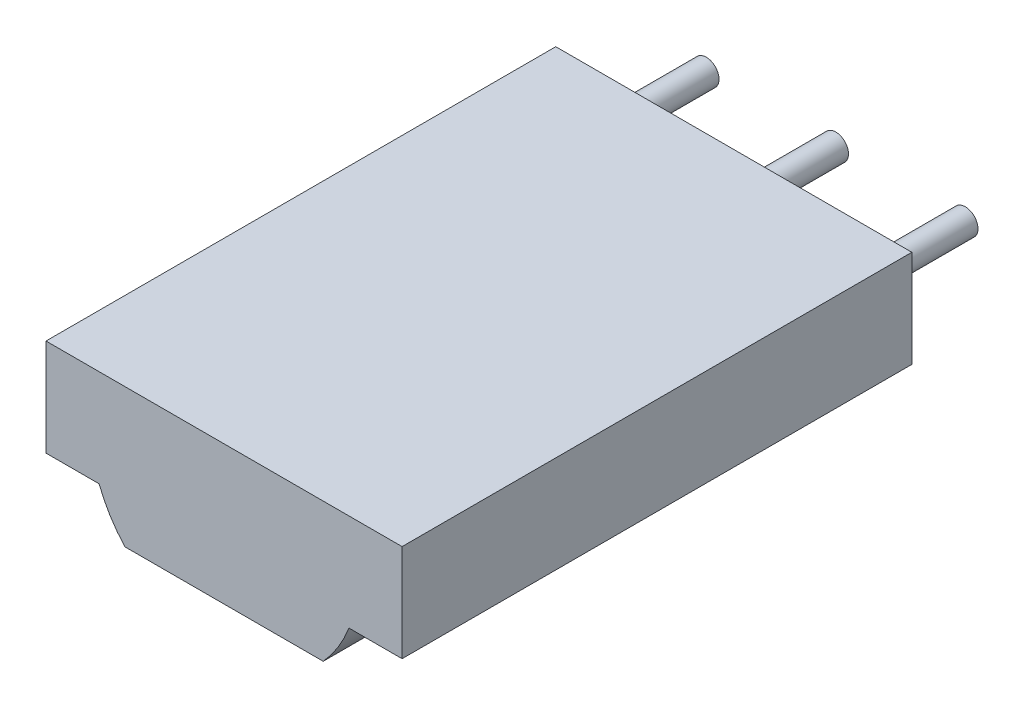
ISO-10303-21;
HEADER;
FILE_DESCRIPTION(('STEP AP214'),'2;1');
FILE_NAME('part.step','',(''),(''),'','','');
FILE_SCHEMA(('AUTOMOTIVE_DESIGN { 1 0 10303 214 1 1 1 1 }'));
ENDSEC;
DATA;
#1=APPLICATION_CONTEXT('core data for automotive mechanical design processes');
#2=APPLICATION_PROTOCOL_DEFINITION('international standard','automotive_design',2000,#1);
#3=PRODUCT_CONTEXT('',#1,'mechanical');
#4=PRODUCT('Part','Part','',(#3));
#5=PRODUCT_RELATED_PRODUCT_CATEGORY('part','',(#4));
#6=PRODUCT_DEFINITION_FORMATION('','',#4);
#7=PRODUCT_DEFINITION_CONTEXT('part definition',#1,'design');
#8=PRODUCT_DEFINITION('design','',#6,#7);
#9=PRODUCT_DEFINITION_SHAPE('','',#8);
#10=(LENGTH_UNIT() NAMED_UNIT(*) SI_UNIT(.MILLI.,.METRE.));
#11=(NAMED_UNIT(*) PLANE_ANGLE_UNIT() SI_UNIT($,.RADIAN.));
#12=(NAMED_UNIT(*) SI_UNIT($,.STERADIAN.) SOLID_ANGLE_UNIT());
#13=UNCERTAINTY_MEASURE_WITH_UNIT(LENGTH_MEASURE(1.E-05),#10,'distance_accuracy_value','');
#14=(GEOMETRIC_REPRESENTATION_CONTEXT(3) GLOBAL_UNCERTAINTY_ASSIGNED_CONTEXT((#13)) GLOBAL_UNIT_ASSIGNED_CONTEXT((#10,
#11,#12)) REPRESENTATION_CONTEXT('',''));
#15=CARTESIAN_POINT('',(0.,0.,0.));
#16=DIRECTION('',(0.,0.,1.));
#17=DIRECTION('',(1.,0.,0.));
#18=AXIS2_PLACEMENT_3D('',#15,#16,#17);
#19=CARTESIAN_POINT('',(5.08,0.,-2.));
#20=DIRECTION('',(0.,0.,1.));
#21=DIRECTION('',(1.,0.,0.));
#22=AXIS2_PLACEMENT_3D('',#19,#20,#21);
#23=CYLINDRICAL_SURFACE('',#22,0.25);
#24=CARTESIAN_POINT('',(5.08,0.,-2.));
#25=DIRECTION('',(0.,0.,1.));
#26=DIRECTION('',(1.,0.,0.));
#27=AXIS2_PLACEMENT_3D('',#24,#25,#26);
#28=CIRCLE('',#27,0.25);
#29=CARTESIAN_POINT('',(5.33,0.,-2.));
#30=VERTEX_POINT('',#29);
#31=EDGE_CURVE('E11',#30,#30,#28,.T.);
#32=ORIENTED_EDGE('',*,*,#31,.T.);
#33=EDGE_LOOP('',(#32));
#34=FACE_BOUND('',#33,.T.);
#35=CARTESIAN_POINT('',(5.08,0.,0.));
#36=DIRECTION('',(0.,0.,1.));
#37=DIRECTION('',(1.,0.,0.));
#38=AXIS2_PLACEMENT_3D('',#35,#36,#37);
#39=CIRCLE('',#38,0.25);
#40=CARTESIAN_POINT('',(5.33,0.,0.));
#41=VERTEX_POINT('',#40);
#42=EDGE_CURVE('E43',#41,#41,#39,.T.);
#43=ORIENTED_EDGE('',*,*,#42,.F.);
#44=EDGE_LOOP('',(#43));
#45=FACE_BOUND('',#44,.T.);
#46=ADVANCED_FACE('F40',(#34,#45),#23,.T.);
#47=CARTESIAN_POINT('',(5.08,0.,-2.));
#48=DIRECTION('',(0.,0.,1.));
#49=DIRECTION('',(1.,0.,0.));
#50=AXIS2_PLACEMENT_3D('',#47,#48,#49);
#51=PLANE('',#50);
#52=ORIENTED_EDGE('',*,*,#31,.F.);
#53=EDGE_LOOP('',(#52));
#54=FACE_BOUND('',#53,.T.);
#55=ADVANCED_FACE('F55',(#54),#51,.F.);
#56=CARTESIAN_POINT('',(5.08,0.,0.));
#57=DIRECTION('',(0.,0.,1.));
#58=DIRECTION('',(1.,0.,0.));
#59=AXIS2_PLACEMENT_3D('',#56,#57,#58);
#60=PLANE('',#59);
#61=ORIENTED_EDGE('',*,*,#42,.T.);
#62=EDGE_LOOP('',(#61));
#63=FACE_BOUND('',#62,.T.);
#64=ADVANCED_FACE('F52',(#63),#60,.T.);
#65=CLOSED_SHELL('',(#46,#55,#64));
#66=MANIFOLD_SOLID_BREP('B2',#65);
#67=CARTESIAN_POINT('',(2.54,0.,-2.));
#68=DIRECTION('',(0.,0.,1.));
#69=DIRECTION('',(1.,0.,0.));
#70=AXIS2_PLACEMENT_3D('',#67,#68,#69);
#71=CYLINDRICAL_SURFACE('',#70,0.25);
#72=CARTESIAN_POINT('',(2.54,0.,-2.));
#73=DIRECTION('',(0.,0.,1.));
#74=DIRECTION('',(1.,0.,0.));
#75=AXIS2_PLACEMENT_3D('',#72,#73,#74);
#76=CIRCLE('',#75,0.25);
#77=CARTESIAN_POINT('',(2.79,0.,-2.));
#78=VERTEX_POINT('',#77);
#79=EDGE_CURVE('E39',#78,#78,#76,.T.);
#80=ORIENTED_EDGE('',*,*,#79,.T.);
#81=EDGE_LOOP('',(#80));
#82=FACE_BOUND('',#81,.T.);
#83=CARTESIAN_POINT('',(2.54,0.,0.));
#84=DIRECTION('',(0.,0.,1.));
#85=DIRECTION('',(1.,0.,0.));
#86=AXIS2_PLACEMENT_3D('',#83,#84,#85);
#87=CIRCLE('',#86,0.25);
#88=CARTESIAN_POINT('',(2.79,0.,0.));
#89=VERTEX_POINT('',#88);
#90=EDGE_CURVE('E92',#89,#89,#87,.T.);
#91=ORIENTED_EDGE('',*,*,#90,.F.);
#92=EDGE_LOOP('',(#91));
#93=FACE_BOUND('',#92,.T.);
#94=ADVANCED_FACE('F89',(#82,#93),#71,.T.);
#95=CARTESIAN_POINT('',(2.54,0.,-2.));
#96=DIRECTION('',(0.,0.,1.));
#97=DIRECTION('',(1.,0.,0.));
#98=AXIS2_PLACEMENT_3D('',#95,#96,#97);
#99=PLANE('',#98);
#100=ORIENTED_EDGE('',*,*,#79,.F.);
#101=EDGE_LOOP('',(#100));
#102=FACE_BOUND('',#101,.T.);
#103=ADVANCED_FACE('F104',(#102),#99,.F.);
#104=CARTESIAN_POINT('',(2.54,0.,0.));
#105=DIRECTION('',(0.,0.,1.));
#106=DIRECTION('',(1.,0.,0.));
#107=AXIS2_PLACEMENT_3D('',#104,#105,#106);
#108=PLANE('',#107);
#109=ORIENTED_EDGE('',*,*,#90,.T.);
#110=EDGE_LOOP('',(#109));
#111=FACE_BOUND('',#110,.T.);
#112=ADVANCED_FACE('F101',(#111),#108,.T.);
#113=CLOSED_SHELL('',(#94,#103,#112));
#114=MANIFOLD_SOLID_BREP('B6',#113);
#115=CARTESIAN_POINT('',(0.,0.,-2.));
#116=DIRECTION('',(0.,0.,1.));
#117=DIRECTION('',(1.,0.,0.));
#118=AXIS2_PLACEMENT_3D('',#115,#116,#117);
#119=CYLINDRICAL_SURFACE('',#118,0.25);
#120=CARTESIAN_POINT('',(0.,0.,-2.));
#121=DIRECTION('',(0.,0.,1.));
#122=DIRECTION('',(1.,0.,0.));
#123=AXIS2_PLACEMENT_3D('',#120,#121,#122);
#124=CIRCLE('',#123,0.25);
#125=CARTESIAN_POINT('',(0.25,0.,-2.));
#126=VERTEX_POINT('',#125);
#127=EDGE_CURVE('E88',#126,#126,#124,.T.);
#128=ORIENTED_EDGE('',*,*,#127,.T.);
#129=EDGE_LOOP('',(#128));
#130=FACE_BOUND('',#129,.T.);
#131=CARTESIAN_POINT('',(0.,0.,0.));
#132=DIRECTION('',(0.,0.,1.));
#133=DIRECTION('',(1.,0.,0.));
#134=AXIS2_PLACEMENT_3D('',#131,#132,#133);
#135=CIRCLE('',#134,0.25);
#136=CARTESIAN_POINT('',(0.25,0.,0.));
#137=VERTEX_POINT('',#136);
#138=EDGE_CURVE('E142',#137,#137,#135,.T.);
#139=ORIENTED_EDGE('',*,*,#138,.F.);
#140=EDGE_LOOP('',(#139));
#141=FACE_BOUND('',#140,.T.);
#142=ADVANCED_FACE('F139',(#130,#141),#119,.T.);
#143=CARTESIAN_POINT('',(0.,0.,-2.));
#144=DIRECTION('',(0.,0.,1.));
#145=DIRECTION('',(1.,0.,0.));
#146=AXIS2_PLACEMENT_3D('',#143,#144,#145);
#147=PLANE('',#146);
#148=ORIENTED_EDGE('',*,*,#127,.F.);
#149=EDGE_LOOP('',(#148));
#150=FACE_BOUND('',#149,.T.);
#151=ADVANCED_FACE('F154',(#150),#147,.F.);
#152=CARTESIAN_POINT('',(0.,0.,0.));
#153=DIRECTION('',(0.,0.,1.));
#154=DIRECTION('',(1.,0.,0.));
#155=AXIS2_PLACEMENT_3D('',#152,#153,#154);
#156=PLANE('',#155);
#157=ORIENTED_EDGE('',*,*,#138,.T.);
#158=EDGE_LOOP('',(#157));
#159=FACE_BOUND('',#158,.T.);
#160=ADVANCED_FACE('F151',(#159),#156,.T.);
#161=CLOSED_SHELL('',(#142,#151,#160));
#162=MANIFOLD_SOLID_BREP('B34',#161);
#163=CARTESIAN_POINT('',(-0.9525,0.9525,10.));
#164=DIRECTION('',(1.,0.,0.));
#165=DIRECTION('',(0.,0.,-1.));
#166=AXIS2_PLACEMENT_3D('',#163,#164,#165);
#167=PLANE('',#166);
#168=DIRECTION('',(0.,-1.,0.));
#169=VECTOR('',#168,1.);
#170=CARTESIAN_POINT('',(-0.9525,0.9525,0.));
#171=LINE('',#170,#169);
#172=CARTESIAN_POINT('',(-0.9525,0.9525,0.));
#173=VERTEX_POINT('',#172);
#174=CARTESIAN_POINT('',(-0.9525,-0.9525,0.));
#175=VERTEX_POINT('',#174);
#176=EDGE_CURVE('E276',#173,#175,#171,.T.);
#177=ORIENTED_EDGE('',*,*,#176,.T.);
#178=DIRECTION('',(0.,0.,-1.));
#179=VECTOR('',#178,1.);
#180=CARTESIAN_POINT('',(-0.9525,-0.9525,10.));
#181=LINE('',#180,#179);
#182=CARTESIAN_POINT('',(-0.9525,-0.9525,10.));
#183=VERTEX_POINT('',#182);
#184=EDGE_CURVE('E188',#183,#175,#181,.T.);
#185=ORIENTED_EDGE('',*,*,#184,.F.);
#186=DIRECTION('',(0.,-1.,0.));
#187=VECTOR('',#186,1.);
#188=CARTESIAN_POINT('',(-0.9525,0.9525,10.));
#189=LINE('',#188,#187);
#190=CARTESIAN_POINT('',(-0.9525,0.9525,10.));
#191=VERTEX_POINT('',#190);
#192=EDGE_CURVE('E323',#191,#183,#189,.T.);
#193=ORIENTED_EDGE('',*,*,#192,.F.);
#194=DIRECTION('',(0.,0.,-1.));
#195=VECTOR('',#194,1.);
#196=CARTESIAN_POINT('',(-0.9525,0.9525,10.));
#197=LINE('',#196,#195);
#198=EDGE_CURVE('E137',#191,#173,#197,.T.);
#199=ORIENTED_EDGE('',*,*,#198,.T.);
#200=EDGE_LOOP('',(#177,#185,#193,#199));
#201=FACE_BOUND('',#200,.T.);
#202=ADVANCED_FACE('F180',(#201),#167,.F.);
#203=CARTESIAN_POINT('',(-0.9525,-0.9525,10.));
#204=DIRECTION('',(0.,1.,0.));
#205=DIRECTION('',(0.,0.,1.));
#206=AXIS2_PLACEMENT_3D('',#203,#204,#205);
#207=PLANE('',#206);
#208=DIRECTION('',(1.,0.,0.));
#209=VECTOR('',#208,1.);
#210=CARTESIAN_POINT('',(-0.9525,-0.9525,0.));
#211=LINE('',#210,#209);
#212=CARTESIAN_POINT('',(0.0885,-0.9525,0.));
#213=VERTEX_POINT('',#212);
#214=EDGE_CURVE('E278',#175,#213,#211,.T.);
#215=ORIENTED_EDGE('',*,*,#214,.T.);
#216=DIRECTION('',(0.,0.,-1.));
#217=VECTOR('',#216,1.);
#218=CARTESIAN_POINT('',(0.0885,-0.9525,10.));
#219=LINE('',#218,#217);
#220=CARTESIAN_POINT('',(0.0885,-0.9525,10.));
#221=VERTEX_POINT('',#220);
#222=EDGE_CURVE('E295',#221,#213,#219,.T.);
#223=ORIENTED_EDGE('',*,*,#222,.F.);
#224=DIRECTION('',(1.,0.,0.));
#225=VECTOR('',#224,1.);
#226=CARTESIAN_POINT('',(-0.9525,-0.9525,10.));
#227=LINE('',#226,#225);
#228=EDGE_CURVE('E304',#183,#221,#227,.T.);
#229=ORIENTED_EDGE('',*,*,#228,.F.);
#230=ORIENTED_EDGE('',*,*,#184,.T.);
#231=EDGE_LOOP('',(#215,#223,#229,#230));
#232=FACE_BOUND('',#231,.T.);
#233=ADVANCED_FACE('F302',(#232),#207,.F.);
#234=CARTESIAN_POINT('',(2.53996131256683,-1.39187506676547E-05,10.));
#235=DIRECTION('',(0.,0.,-1.));
#236=DIRECTION('',(-1.,0.,0.));
#237=AXIS2_PLACEMENT_3D('',#234,#235,#236);
#238=CYLINDRICAL_SURFACE('',#237,2.62999853649876);
#239=CARTESIAN_POINT('',(2.53996131256683,-1.39187506676547E-05,0.));
#240=DIRECTION('',(0.,0.,1.));
#241=DIRECTION('',(1.,0.,0.));
#242=AXIS2_PLACEMENT_3D('',#239,#240,#241);
#243=CIRCLE('',#242,2.62999853649876);
#244=CARTESIAN_POINT('',(0.594699999999999,-1.77,0.));
#245=VERTEX_POINT('',#244);
#246=EDGE_CURVE('E280',#213,#245,#243,.T.);
#247=ORIENTED_EDGE('',*,*,#246,.T.);
#248=DIRECTION('',(0.,0.,-1.));
#249=VECTOR('',#248,1.);
#250=CARTESIAN_POINT('',(0.594699999999999,-1.77,10.));
#251=LINE('',#250,#249);
#252=CARTESIAN_POINT('',(0.594699999999999,-1.77,10.));
#253=VERTEX_POINT('',#252);
#254=EDGE_CURVE('E292',#253,#245,#251,.T.);
#255=ORIENTED_EDGE('',*,*,#254,.F.);
#256=CARTESIAN_POINT('',(2.53996131256683,-1.39187506676547E-05,10.));
#257=DIRECTION('',(0.,0.,1.));
#258=DIRECTION('',(1.,0.,0.));
#259=AXIS2_PLACEMENT_3D('',#256,#257,#258);
#260=CIRCLE('',#259,2.62999853649876);
#261=EDGE_CURVE('E319',#221,#253,#260,.T.);
#262=ORIENTED_EDGE('',*,*,#261,.F.);
#263=ORIENTED_EDGE('',*,*,#222,.T.);
#264=EDGE_LOOP('',(#247,#255,#262,#263));
#265=FACE_BOUND('',#264,.T.);
#266=ADVANCED_FACE('F315',(#265),#238,.T.);
#267=CARTESIAN_POINT('',(0.5947,-1.77,10.));
#268=DIRECTION('',(0.,1.,0.));
#269=DIRECTION('',(0.,0.,1.));
#270=AXIS2_PLACEMENT_3D('',#267,#268,#269);
#271=PLANE('',#270);
#272=DIRECTION('',(1.,0.,0.));
#273=VECTOR('',#272,1.);
#274=CARTESIAN_POINT('',(0.5947,-1.77,0.));
#275=LINE('',#274,#273);
#276=CARTESIAN_POINT('',(4.4852,-1.77,0.));
#277=VERTEX_POINT('',#276);
#278=EDGE_CURVE('E282',#245,#277,#275,.T.);
#279=ORIENTED_EDGE('',*,*,#278,.T.);
#280=DIRECTION('',(0.,0.,-1.));
#281=VECTOR('',#280,1.);
#282=CARTESIAN_POINT('',(4.4852,-1.77,10.));
#283=LINE('',#282,#281);
#284=CARTESIAN_POINT('',(4.4852,-1.77,10.));
#285=VERTEX_POINT('',#284);
#286=EDGE_CURVE('E265',#285,#277,#283,.T.);
#287=ORIENTED_EDGE('',*,*,#286,.F.);
#288=DIRECTION('',(1.,0.,0.));
#289=VECTOR('',#288,1.);
#290=CARTESIAN_POINT('',(0.5947,-1.77,10.));
#291=LINE('',#290,#289);
#292=EDGE_CURVE('E256',#253,#285,#291,.T.);
#293=ORIENTED_EDGE('',*,*,#292,.F.);
#294=ORIENTED_EDGE('',*,*,#254,.T.);
#295=EDGE_LOOP('',(#279,#287,#293,#294));
#296=FACE_BOUND('',#295,.T.);
#297=ADVANCED_FACE('F318',(#296),#271,.F.);
#298=CARTESIAN_POINT('',(2.53993868743317,-1.39187506674378E-05,10.));
#299=DIRECTION('',(0.,0.,-1.));
#300=DIRECTION('',(-1.,0.,0.));
#301=AXIS2_PLACEMENT_3D('',#298,#299,#300);
#302=CYLINDRICAL_SURFACE('',#301,2.62999853649876);
#303=CARTESIAN_POINT('',(2.53993868743317,-1.39187506674378E-05,0.));
#304=DIRECTION('',(0.,0.,1.));
#305=DIRECTION('',(1.,0.,0.));
#306=AXIS2_PLACEMENT_3D('',#303,#304,#305);
#307=CIRCLE('',#306,2.62999853649876);
#308=CARTESIAN_POINT('',(4.9914,-0.9525,0.));
#309=VERTEX_POINT('',#308);
#310=EDGE_CURVE('E264',#277,#309,#307,.T.);
#311=ORIENTED_EDGE('',*,*,#310,.T.);
#312=DIRECTION('',(0.,0.,-1.));
#313=VECTOR('',#312,1.);
#314=CARTESIAN_POINT('',(4.9914,-0.9525,10.));
#315=LINE('',#314,#313);
#316=CARTESIAN_POINT('',(4.9914,-0.9525,10.));
#317=VERTEX_POINT('',#316);
#318=EDGE_CURVE('E261',#317,#309,#315,.T.);
#319=ORIENTED_EDGE('',*,*,#318,.F.);
#320=CARTESIAN_POINT('',(2.53993868743317,-1.39187506674378E-05,10.));
#321=DIRECTION('',(0.,0.,1.));
#322=DIRECTION('',(1.,0.,0.));
#323=AXIS2_PLACEMENT_3D('',#320,#321,#322);
#324=CIRCLE('',#323,2.62999853649876);
#325=EDGE_CURVE('E250',#285,#317,#324,.T.);
#326=ORIENTED_EDGE('',*,*,#325,.F.);
#327=ORIENTED_EDGE('',*,*,#286,.T.);
#328=EDGE_LOOP('',(#311,#319,#326,#327));
#329=FACE_BOUND('',#328,.T.);
#330=ADVANCED_FACE('F262',(#329),#302,.T.);
#331=CARTESIAN_POINT('',(4.9914,-0.9525,10.));
#332=DIRECTION('',(0.,1.,0.));
#333=DIRECTION('',(0.,0.,1.));
#334=AXIS2_PLACEMENT_3D('',#331,#332,#333);
#335=PLANE('',#334);
#336=DIRECTION('',(1.,0.,0.));
#337=VECTOR('',#336,1.);
#338=CARTESIAN_POINT('',(4.9914,-0.9525,0.));
#339=LINE('',#338,#337);
#340=CARTESIAN_POINT('',(6.0325,-0.9525,0.));
#341=VERTEX_POINT('',#340);
#342=EDGE_CURVE('E226',#309,#341,#339,.T.);
#343=ORIENTED_EDGE('',*,*,#342,.T.);
#344=DIRECTION('',(0.,0.,-1.));
#345=VECTOR('',#344,1.);
#346=CARTESIAN_POINT('',(6.0325,-0.9525,10.));
#347=LINE('',#346,#345);
#348=CARTESIAN_POINT('',(6.0325,-0.9525,10.));
#349=VERTEX_POINT('',#348);
#350=EDGE_CURVE('E266',#349,#341,#347,.T.);
#351=ORIENTED_EDGE('',*,*,#350,.F.);
#352=DIRECTION('',(1.,0.,0.));
#353=VECTOR('',#352,1.);
#354=CARTESIAN_POINT('',(4.9914,-0.9525,10.));
#355=LINE('',#354,#353);
#356=EDGE_CURVE('E254',#317,#349,#355,.T.);
#357=ORIENTED_EDGE('',*,*,#356,.F.);
#358=ORIENTED_EDGE('',*,*,#318,.T.);
#359=EDGE_LOOP('',(#343,#351,#357,#358));
#360=FACE_BOUND('',#359,.T.);
#361=ADVANCED_FACE('F268',(#360),#335,.F.);
#362=CARTESIAN_POINT('',(6.0325,-0.9525,10.));
#363=DIRECTION('',(-1.,0.,0.));
#364=DIRECTION('',(0.,0.,1.));
#365=AXIS2_PLACEMENT_3D('',#362,#363,#364);
#366=PLANE('',#365);
#367=DIRECTION('',(0.,1.,0.));
#368=VECTOR('',#367,1.);
#369=CARTESIAN_POINT('',(6.0325,-0.9525,0.));
#370=LINE('',#369,#368);
#371=CARTESIAN_POINT('',(6.0325,0.9525,0.));
#372=VERTEX_POINT('',#371);
#373=EDGE_CURVE('E233',#341,#372,#370,.T.);
#374=ORIENTED_EDGE('',*,*,#373,.T.);
#375=DIRECTION('',(0.,0.,-1.));
#376=VECTOR('',#375,1.);
#377=CARTESIAN_POINT('',(6.0325,0.9525,10.));
#378=LINE('',#377,#376);
#379=CARTESIAN_POINT('',(6.0325,0.9525,10.));
#380=VERTEX_POINT('',#379);
#381=EDGE_CURVE('E272',#380,#372,#378,.T.);
#382=ORIENTED_EDGE('',*,*,#381,.F.);
#383=DIRECTION('',(0.,1.,0.));
#384=VECTOR('',#383,1.);
#385=CARTESIAN_POINT('',(6.0325,-0.9525,10.));
#386=LINE('',#385,#384);
#387=EDGE_CURVE('E270',#349,#380,#386,.T.);
#388=ORIENTED_EDGE('',*,*,#387,.F.);
#389=ORIENTED_EDGE('',*,*,#350,.T.);
#390=EDGE_LOOP('',(#374,#382,#388,#389));
#391=FACE_BOUND('',#390,.T.);
#392=ADVANCED_FACE('F326',(#391),#366,.F.);
#393=CARTESIAN_POINT('',(6.0325,0.9525,10.));
#394=DIRECTION('',(0.,-1.,0.));
#395=DIRECTION('',(0.,0.,-1.));
#396=AXIS2_PLACEMENT_3D('',#393,#394,#395);
#397=PLANE('',#396);
#398=DIRECTION('',(-1.,0.,0.));
#399=VECTOR('',#398,1.);
#400=CARTESIAN_POINT('',(6.0325,0.9525,0.));
#401=LINE('',#400,#399);
#402=EDGE_CURVE('E287',#372,#173,#401,.T.);
#403=ORIENTED_EDGE('',*,*,#402,.T.);
#404=ORIENTED_EDGE('',*,*,#198,.F.);
#405=DIRECTION('',(-1.,0.,0.));
#406=VECTOR('',#405,1.);
#407=CARTESIAN_POINT('',(4.9914,0.9525,10.));
#408=LINE('',#407,#406);
#409=EDGE_CURVE('E196',#380,#191,#408,.T.);
#410=ORIENTED_EDGE('',*,*,#409,.F.);
#411=ORIENTED_EDGE('',*,*,#381,.T.);
#412=EDGE_LOOP('',(#403,#404,#410,#411));
#413=FACE_BOUND('',#412,.T.);
#414=ADVANCED_FACE('F325',(#413),#397,.F.);
#415=CARTESIAN_POINT('',(2.53996131256683,-1.39187506676547E-05,10.));
#416=DIRECTION('',(0.,0.,1.));
#417=DIRECTION('',(1.,0.,0.));
#418=AXIS2_PLACEMENT_3D('',#415,#416,#417);
#419=PLANE('',#418);
#420=ORIENTED_EDGE('',*,*,#409,.T.);
#421=ORIENTED_EDGE('',*,*,#192,.T.);
#422=ORIENTED_EDGE('',*,*,#228,.T.);
#423=ORIENTED_EDGE('',*,*,#261,.T.);
#424=ORIENTED_EDGE('',*,*,#292,.T.);
#425=ORIENTED_EDGE('',*,*,#325,.T.);
#426=ORIENTED_EDGE('',*,*,#356,.T.);
#427=ORIENTED_EDGE('',*,*,#387,.T.);
#428=EDGE_LOOP('',(#420,#421,#422,#423,#424,#425,#426,#427));
#429=FACE_BOUND('',#428,.T.);
#430=ADVANCED_FACE('F252',(#429),#419,.T.);
#431=CARTESIAN_POINT('',(2.53996131256683,-1.39187506676547E-05,0.));
#432=DIRECTION('',(0.,0.,1.));
#433=DIRECTION('',(1.,0.,0.));
#434=AXIS2_PLACEMENT_3D('',#431,#432,#433);
#435=PLANE('',#434);
#436=ORIENTED_EDGE('',*,*,#176,.F.);
#437=ORIENTED_EDGE('',*,*,#402,.F.);
#438=ORIENTED_EDGE('',*,*,#373,.F.);
#439=ORIENTED_EDGE('',*,*,#342,.F.);
#440=ORIENTED_EDGE('',*,*,#310,.F.);
#441=ORIENTED_EDGE('',*,*,#278,.F.);
#442=ORIENTED_EDGE('',*,*,#246,.F.);
#443=ORIENTED_EDGE('',*,*,#214,.F.);
#444=EDGE_LOOP('',(#436,#437,#438,#439,#440,#441,#442,#443));
#445=FACE_BOUND('',#444,.T.);
#446=ADVANCED_FACE('F310',(#445),#435,.F.);
#447=CLOSED_SHELL('',(#202,#233,#266,#297,#330,#361,#392,#414,#430,#446));
#448=MANIFOLD_SOLID_BREP('B83',#447);
#449=ADVANCED_BREP_SHAPE_REPRESENTATION('',(#18,#66,#114,#162,#448),#14);
#450=SHAPE_DEFINITION_REPRESENTATION(#9,#449);
ENDSEC;
END-ISO-10303-21;
